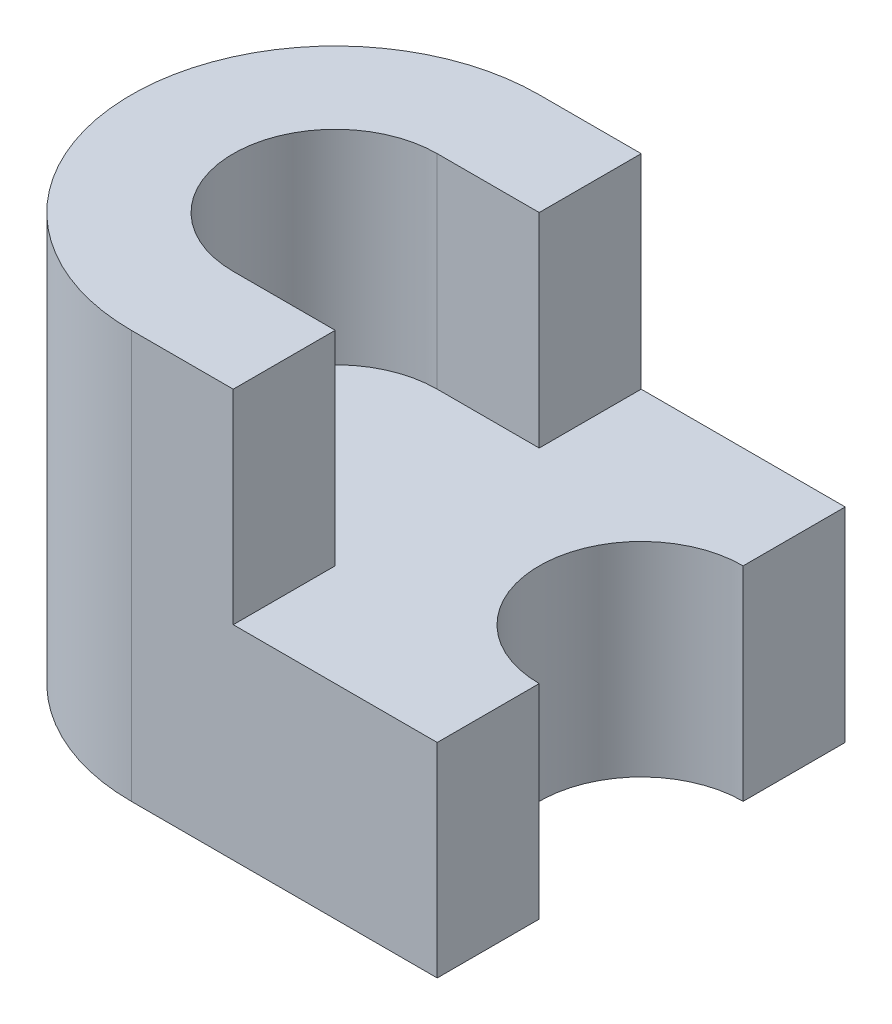
ISO-10303-21;
HEADER;
FILE_DESCRIPTION(('STEP AP214'),'2;1');
FILE_NAME('part.step','',(''),(''),'','','');
FILE_SCHEMA(('AUTOMOTIVE_DESIGN { 1 0 10303 214 1 1 1 1 }'));
ENDSEC;
DATA;
#1=APPLICATION_CONTEXT('core data for automotive mechanical design processes');
#2=APPLICATION_PROTOCOL_DEFINITION('international standard','automotive_design',2000,#1);
#3=PRODUCT_CONTEXT('',#1,'mechanical');
#4=PRODUCT('Part','Part','',(#3));
#5=PRODUCT_RELATED_PRODUCT_CATEGORY('part','',(#4));
#6=PRODUCT_DEFINITION_FORMATION('','',#4);
#7=PRODUCT_DEFINITION_CONTEXT('part definition',#1,'design');
#8=PRODUCT_DEFINITION('design','',#6,#7);
#9=PRODUCT_DEFINITION_SHAPE('','',#8);
#10=(LENGTH_UNIT() NAMED_UNIT(*) SI_UNIT(.MILLI.,.METRE.));
#11=(NAMED_UNIT(*) PLANE_ANGLE_UNIT() SI_UNIT($,.RADIAN.));
#12=(NAMED_UNIT(*) SI_UNIT($,.STERADIAN.) SOLID_ANGLE_UNIT());
#13=UNCERTAINTY_MEASURE_WITH_UNIT(LENGTH_MEASURE(1.E-05),#10,'distance_accuracy_value','');
#14=(GEOMETRIC_REPRESENTATION_CONTEXT(3) GLOBAL_UNCERTAINTY_ASSIGNED_CONTEXT((#13)) GLOBAL_UNIT_ASSIGNED_CONTEXT((#10,
#11,#12)) REPRESENTATION_CONTEXT('',''));
#15=CARTESIAN_POINT('',(0.,0.,0.));
#16=DIRECTION('',(0.,0.,1.));
#17=DIRECTION('',(1.,0.,0.));
#18=AXIS2_PLACEMENT_3D('',#15,#16,#17);
#19=CARTESIAN_POINT('',(0.,10.,-10.));
#20=DIRECTION('',(0.,0.,-1.));
#21=DIRECTION('',(-1.,0.,0.));
#22=AXIS2_PLACEMENT_3D('',#19,#20,#21);
#23=PLANE('',#22);
#24=DIRECTION('',(0.,-1.,0.));
#25=VECTOR('',#24,1.);
#26=CARTESIAN_POINT('',(15.,10.,-10.));
#27=LINE('',#26,#25);
#28=CARTESIAN_POINT('',(15.,10.,-10.));
#29=VERTEX_POINT('',#28);
#30=CARTESIAN_POINT('',(15.,0.,-10.));
#31=VERTEX_POINT('',#30);
#32=EDGE_CURVE('E198',#29,#31,#27,.T.);
#33=ORIENTED_EDGE('',*,*,#32,.T.);
#34=DIRECTION('',(1.,0.,0.));
#35=VECTOR('',#34,1.);
#36=CARTESIAN_POINT('',(0.,0.,-10.));
#37=LINE('',#36,#35);
#38=CARTESIAN_POINT('',(0.,0.,-10.));
#39=VERTEX_POINT('',#38);
#40=EDGE_CURVE('E182',#39,#31,#37,.T.);
#41=ORIENTED_EDGE('',*,*,#40,.F.);
#42=DIRECTION('',(0.,-1.,0.));
#43=VECTOR('',#42,1.);
#44=CARTESIAN_POINT('',(0.,10.,-10.));
#45=LINE('',#44,#43);
#46=CARTESIAN_POINT('',(0.,20.,-10.));
#47=VERTEX_POINT('',#46);
#48=EDGE_CURVE('E11',#47,#39,#45,.T.);
#49=ORIENTED_EDGE('',*,*,#48,.F.);
#50=DIRECTION('',(1.,0.,0.));
#51=VECTOR('',#50,1.);
#52=CARTESIAN_POINT('',(0.,20.,-10.));
#53=LINE('',#52,#51);
#54=CARTESIAN_POINT('',(5.,20.,-10.));
#55=VERTEX_POINT('',#54);
#56=EDGE_CURVE('E151',#47,#55,#53,.T.);
#57=ORIENTED_EDGE('',*,*,#56,.T.);
#58=DIRECTION('',(0.,-1.,0.));
#59=VECTOR('',#58,1.);
#60=CARTESIAN_POINT('',(5.,20.,-10.));
#61=LINE('',#60,#59);
#62=CARTESIAN_POINT('',(5.,10.,-10.));
#63=VERTEX_POINT('',#62);
#64=EDGE_CURVE('E171',#55,#63,#61,.T.);
#65=ORIENTED_EDGE('',*,*,#64,.T.);
#66=DIRECTION('',(1.,0.,0.));
#67=VECTOR('',#66,1.);
#68=CARTESIAN_POINT('',(0.,10.,-10.));
#69=LINE('',#68,#67);
#70=EDGE_CURVE('E183',#63,#29,#69,.T.);
#71=ORIENTED_EDGE('',*,*,#70,.T.);
#72=EDGE_LOOP('',(#33,#41,#49,#57,#65,#71));
#73=FACE_BOUND('',#72,.T.);
#74=ADVANCED_FACE('F39',(#73),#23,.T.);
#75=CARTESIAN_POINT('',(0.,10.,0.));
#76=DIRECTION('',(0.,-1.,0.));
#77=DIRECTION('',(0.,0.,-1.));
#78=AXIS2_PLACEMENT_3D('',#75,#76,#77);
#79=CYLINDRICAL_SURFACE('',#78,10.);
#80=CARTESIAN_POINT('',(0.,0.,0.));
#81=DIRECTION('',(0.,1.,0.));
#82=DIRECTION('',(0.,0.,1.));
#83=AXIS2_PLACEMENT_3D('',#80,#81,#82);
#84=CIRCLE('',#83,10.);
#85=CARTESIAN_POINT('',(0.,0.,10.));
#86=VERTEX_POINT('',#85);
#87=EDGE_CURVE('E200',#39,#86,#84,.T.);
#88=ORIENTED_EDGE('',*,*,#87,.T.);
#89=DIRECTION('',(0.,-1.,0.));
#90=VECTOR('',#89,1.);
#91=CARTESIAN_POINT('',(0.,10.,10.));
#92=LINE('',#91,#90);
#93=CARTESIAN_POINT('',(0.,20.,10.));
#94=VERTEX_POINT('',#93);
#95=EDGE_CURVE('E46',#94,#86,#92,.T.);
#96=ORIENTED_EDGE('',*,*,#95,.F.);
#97=CARTESIAN_POINT('',(0.,20.,0.));
#98=DIRECTION('',(0.,1.,0.));
#99=DIRECTION('',(0.,0.,1.));
#100=AXIS2_PLACEMENT_3D('',#97,#98,#99);
#101=CIRCLE('',#100,10.);
#102=EDGE_CURVE('E154',#47,#94,#101,.T.);
#103=ORIENTED_EDGE('',*,*,#102,.F.);
#104=ORIENTED_EDGE('',*,*,#48,.T.);
#105=EDGE_LOOP('',(#88,#96,#103,#104));
#106=FACE_BOUND('',#105,.T.);
#107=ADVANCED_FACE('F228',(#106),#79,.T.);
#108=CARTESIAN_POINT('',(0.,10.,10.));
#109=DIRECTION('',(0.,0.,1.));
#110=DIRECTION('',(1.,0.,0.));
#111=AXIS2_PLACEMENT_3D('',#108,#109,#110);
#112=PLANE('',#111);
#113=ORIENTED_EDGE('',*,*,#95,.T.);
#114=DIRECTION('',(-1.,0.,0.));
#115=VECTOR('',#114,1.);
#116=CARTESIAN_POINT('',(0.,0.,10.));
#117=LINE('',#116,#115);
#118=CARTESIAN_POINT('',(15.,0.,10.));
#119=VERTEX_POINT('',#118);
#120=EDGE_CURVE('E203',#119,#86,#117,.T.);
#121=ORIENTED_EDGE('',*,*,#120,.F.);
#122=DIRECTION('',(0.,-1.,0.));
#123=VECTOR('',#122,1.);
#124=CARTESIAN_POINT('',(15.,10.,10.));
#125=LINE('',#124,#123);
#126=CARTESIAN_POINT('',(15.,10.,10.));
#127=VERTEX_POINT('',#126);
#128=EDGE_CURVE('E219',#127,#119,#125,.T.);
#129=ORIENTED_EDGE('',*,*,#128,.F.);
#130=DIRECTION('',(-1.,0.,0.));
#131=VECTOR('',#130,1.);
#132=CARTESIAN_POINT('',(0.,10.,10.));
#133=LINE('',#132,#131);
#134=CARTESIAN_POINT('',(5.,10.,10.));
#135=VERTEX_POINT('',#134);
#136=EDGE_CURVE('E185',#127,#135,#133,.T.);
#137=ORIENTED_EDGE('',*,*,#136,.T.);
#138=DIRECTION('',(0.,-1.,0.));
#139=VECTOR('',#138,1.);
#140=CARTESIAN_POINT('',(5.,20.,10.));
#141=LINE('',#140,#139);
#142=CARTESIAN_POINT('',(5.,20.,10.));
#143=VERTEX_POINT('',#142);
#144=EDGE_CURVE('E168',#143,#135,#141,.T.);
#145=ORIENTED_EDGE('',*,*,#144,.F.);
#146=DIRECTION('',(-1.,0.,0.));
#147=VECTOR('',#146,1.);
#148=CARTESIAN_POINT('',(0.,20.,10.));
#149=LINE('',#148,#147);
#150=EDGE_CURVE('E157',#143,#94,#149,.T.);
#151=ORIENTED_EDGE('',*,*,#150,.T.);
#152=EDGE_LOOP('',(#113,#121,#129,#137,#145,#151));
#153=FACE_BOUND('',#152,.T.);
#154=ADVANCED_FACE('F223',(#153),#112,.T.);
#155=CARTESIAN_POINT('',(15.,10.,0.));
#156=DIRECTION('',(1.,0.,0.));
#157=DIRECTION('',(0.,0.,-1.));
#158=AXIS2_PLACEMENT_3D('',#155,#156,#157);
#159=PLANE('',#158);
#160=DIRECTION('',(0.,0.,1.));
#161=VECTOR('',#160,1.);
#162=CARTESIAN_POINT('',(15.,0.,0.));
#163=LINE('',#162,#161);
#164=CARTESIAN_POINT('',(15.,0.,5.));
#165=VERTEX_POINT('',#164);
#166=EDGE_CURVE('E205',#165,#119,#163,.T.);
#167=ORIENTED_EDGE('',*,*,#166,.F.);
#168=DIRECTION('',(0.,-1.,0.));
#169=VECTOR('',#168,1.);
#170=CARTESIAN_POINT('',(15.,10.,5.));
#171=LINE('',#170,#169);
#172=CARTESIAN_POINT('',(15.,10.,5.));
#173=VERTEX_POINT('',#172);
#174=EDGE_CURVE('E217',#173,#165,#171,.T.);
#175=ORIENTED_EDGE('',*,*,#174,.F.);
#176=DIRECTION('',(0.,0.,1.));
#177=VECTOR('',#176,1.);
#178=CARTESIAN_POINT('',(15.,10.,0.));
#179=LINE('',#178,#177);
#180=EDGE_CURVE('E189',#173,#127,#179,.T.);
#181=ORIENTED_EDGE('',*,*,#180,.T.);
#182=ORIENTED_EDGE('',*,*,#128,.T.);
#183=EDGE_LOOP('',(#167,#175,#181,#182));
#184=FACE_BOUND('',#183,.T.);
#185=ADVANCED_FACE('F245',(#184),#159,.T.);
#186=CARTESIAN_POINT('',(15.,10.,0.));
#187=DIRECTION('',(0.,-1.,0.));
#188=DIRECTION('',(0.,0.,-1.));
#189=AXIS2_PLACEMENT_3D('',#186,#187,#188);
#190=CYLINDRICAL_SURFACE('',#189,5.);
#191=CARTESIAN_POINT('',(15.,0.,0.));
#192=DIRECTION('',(0.,1.,0.));
#193=DIRECTION('',(0.,0.,1.));
#194=AXIS2_PLACEMENT_3D('',#191,#192,#193);
#195=CIRCLE('',#194,5.);
#196=CARTESIAN_POINT('',(15.,0.,-5.));
#197=VERTEX_POINT('',#196);
#198=EDGE_CURVE('E208',#197,#165,#195,.T.);
#199=ORIENTED_EDGE('',*,*,#198,.F.);
#200=DIRECTION('',(0.,-1.,0.));
#201=VECTOR('',#200,1.);
#202=CARTESIAN_POINT('',(15.,10.,-5.));
#203=LINE('',#202,#201);
#204=CARTESIAN_POINT('',(15.,10.,-5.));
#205=VERTEX_POINT('',#204);
#206=EDGE_CURVE('E215',#205,#197,#203,.T.);
#207=ORIENTED_EDGE('',*,*,#206,.F.);
#208=CARTESIAN_POINT('',(15.,10.,0.));
#209=DIRECTION('',(0.,1.,0.));
#210=DIRECTION('',(0.,0.,1.));
#211=AXIS2_PLACEMENT_3D('',#208,#209,#210);
#212=CIRCLE('',#211,5.);
#213=EDGE_CURVE('E192',#205,#173,#212,.T.);
#214=ORIENTED_EDGE('',*,*,#213,.T.);
#215=ORIENTED_EDGE('',*,*,#174,.T.);
#216=EDGE_LOOP('',(#199,#207,#214,#215));
#217=FACE_BOUND('',#216,.T.);
#218=ADVANCED_FACE('F241',(#217),#190,.F.);
#219=CARTESIAN_POINT('',(15.,10.,0.));
#220=DIRECTION('',(1.,0.,0.));
#221=DIRECTION('',(0.,0.,-1.));
#222=AXIS2_PLACEMENT_3D('',#219,#220,#221);
#223=PLANE('',#222);
#224=DIRECTION('',(0.,0.,1.));
#225=VECTOR('',#224,1.);
#226=CARTESIAN_POINT('',(15.,0.,0.));
#227=LINE('',#226,#225);
#228=EDGE_CURVE('E186',#31,#197,#227,.T.);
#229=ORIENTED_EDGE('',*,*,#228,.F.);
#230=ORIENTED_EDGE('',*,*,#32,.F.);
#231=DIRECTION('',(0.,0.,1.));
#232=VECTOR('',#231,1.);
#233=CARTESIAN_POINT('',(15.,10.,0.));
#234=LINE('',#233,#232);
#235=EDGE_CURVE('E195',#29,#205,#234,.T.);
#236=ORIENTED_EDGE('',*,*,#235,.T.);
#237=ORIENTED_EDGE('',*,*,#206,.T.);
#238=EDGE_LOOP('',(#229,#230,#236,#237));
#239=FACE_BOUND('',#238,.T.);
#240=ADVANCED_FACE('F237',(#239),#223,.T.);
#241=CARTESIAN_POINT('',(0.,10.,0.));
#242=DIRECTION('',(0.,1.,0.));
#243=DIRECTION('',(0.,0.,1.));
#244=AXIS2_PLACEMENT_3D('',#241,#242,#243);
#245=PLANE('',#244);
#246=DIRECTION('',(0.,0.,-1.));
#247=VECTOR('',#246,1.);
#248=CARTESIAN_POINT('',(5.,10.,0.));
#249=LINE('',#248,#247);
#250=CARTESIAN_POINT('',(5.,10.,-5.));
#251=VERTEX_POINT('',#250);
#252=EDGE_CURVE('E53',#251,#63,#249,.T.);
#253=ORIENTED_EDGE('',*,*,#252,.F.);
#254=DIRECTION('',(-1.,0.,0.));
#255=VECTOR('',#254,1.);
#256=CARTESIAN_POINT('',(0.,10.,-5.));
#257=LINE('',#256,#255);
#258=CARTESIAN_POINT('',(0.,10.,-5.));
#259=VERTEX_POINT('',#258);
#260=EDGE_CURVE('E57',#251,#259,#257,.T.);
#261=ORIENTED_EDGE('',*,*,#260,.T.);
#262=CARTESIAN_POINT('',(0.,10.,0.));
#263=DIRECTION('',(0.,1.,0.));
#264=DIRECTION('',(0.,0.,1.));
#265=AXIS2_PLACEMENT_3D('',#262,#263,#264);
#266=CIRCLE('',#265,5.);
#267=CARTESIAN_POINT('',(0.,10.,5.));
#268=VERTEX_POINT('',#267);
#269=EDGE_CURVE('E131',#268,#259,#266,.F.);
#270=ORIENTED_EDGE('',*,*,#269,.F.);
#271=DIRECTION('',(-1.,0.,0.));
#272=VECTOR('',#271,1.);
#273=CARTESIAN_POINT('',(0.,10.,5.));
#274=LINE('',#273,#272);
#275=CARTESIAN_POINT('',(5.,10.,5.));
#276=VERTEX_POINT('',#275);
#277=EDGE_CURVE('E133',#276,#268,#274,.T.);
#278=ORIENTED_EDGE('',*,*,#277,.F.);
#279=DIRECTION('',(0.,0.,1.));
#280=VECTOR('',#279,1.);
#281=CARTESIAN_POINT('',(5.,10.,0.));
#282=LINE('',#281,#280);
#283=EDGE_CURVE('E177',#276,#135,#282,.T.);
#284=ORIENTED_EDGE('',*,*,#283,.T.);
#285=ORIENTED_EDGE('',*,*,#136,.F.);
#286=ORIENTED_EDGE('',*,*,#180,.F.);
#287=ORIENTED_EDGE('',*,*,#213,.F.);
#288=ORIENTED_EDGE('',*,*,#235,.F.);
#289=ORIENTED_EDGE('',*,*,#70,.F.);
#290=EDGE_LOOP('',(#253,#261,#270,#278,#284,#285,#286,#287,#288,#289));
#291=FACE_BOUND('',#290,.T.);
#292=ADVANCED_FACE('F247',(#291),#245,.T.);
#293=CARTESIAN_POINT('',(0.,0.,0.));
#294=DIRECTION('',(0.,1.,0.));
#295=DIRECTION('',(0.,0.,1.));
#296=AXIS2_PLACEMENT_3D('',#293,#294,#295);
#297=PLANE('',#296);
#298=ORIENTED_EDGE('',*,*,#40,.T.);
#299=ORIENTED_EDGE('',*,*,#228,.T.);
#300=ORIENTED_EDGE('',*,*,#198,.T.);
#301=ORIENTED_EDGE('',*,*,#166,.T.);
#302=ORIENTED_EDGE('',*,*,#120,.T.);
#303=ORIENTED_EDGE('',*,*,#87,.F.);
#304=EDGE_LOOP('',(#298,#299,#300,#301,#302,#303));
#305=FACE_BOUND('',#304,.T.);
#306=ADVANCED_FACE('F231',(#305),#297,.F.);
#307=CARTESIAN_POINT('',(0.,20.,0.));
#308=DIRECTION('',(0.,-1.,0.));
#309=DIRECTION('',(0.,0.,-1.));
#310=AXIS2_PLACEMENT_3D('',#307,#308,#309);
#311=CYLINDRICAL_SURFACE('',#310,5.);
#312=DIRECTION('',(0.,-1.,0.));
#313=VECTOR('',#312,1.);
#314=CARTESIAN_POINT('',(0.,20.,5.));
#315=LINE('',#314,#313);
#316=CARTESIAN_POINT('',(0.,20.,5.));
#317=VERTEX_POINT('',#316);
#318=EDGE_CURVE('E163',#317,#268,#315,.T.);
#319=ORIENTED_EDGE('',*,*,#318,.T.);
#320=ORIENTED_EDGE('',*,*,#269,.T.);
#321=DIRECTION('',(0.,-1.,0.));
#322=VECTOR('',#321,1.);
#323=CARTESIAN_POINT('',(0.,20.,-5.));
#324=LINE('',#323,#322);
#325=CARTESIAN_POINT('',(0.,20.,-5.));
#326=VERTEX_POINT('',#325);
#327=EDGE_CURVE('E124',#326,#259,#324,.T.);
#328=ORIENTED_EDGE('',*,*,#327,.F.);
#329=CARTESIAN_POINT('',(0.,20.,0.));
#330=DIRECTION('',(0.,1.,0.));
#331=DIRECTION('',(0.,0.,1.));
#332=AXIS2_PLACEMENT_3D('',#329,#330,#331);
#333=CIRCLE('',#332,5.);
#334=EDGE_CURVE('E129',#326,#317,#333,.T.);
#335=ORIENTED_EDGE('',*,*,#334,.T.);
#336=EDGE_LOOP('',(#319,#320,#328,#335));
#337=FACE_BOUND('',#336,.T.);
#338=ADVANCED_FACE('F127',(#337),#311,.F.);
#339=CARTESIAN_POINT('',(0.,20.,-5.));
#340=DIRECTION('',(0.,0.,-1.));
#341=DIRECTION('',(-1.,0.,0.));
#342=AXIS2_PLACEMENT_3D('',#339,#340,#341);
#343=PLANE('',#342);
#344=ORIENTED_EDGE('',*,*,#260,.F.);
#345=DIRECTION('',(0.,-1.,0.));
#346=VECTOR('',#345,1.);
#347=CARTESIAN_POINT('',(5.,20.,-5.));
#348=LINE('',#347,#346);
#349=CARTESIAN_POINT('',(5.,20.,-5.));
#350=VERTEX_POINT('',#349);
#351=EDGE_CURVE('E134',#350,#251,#348,.T.);
#352=ORIENTED_EDGE('',*,*,#351,.F.);
#353=DIRECTION('',(1.,0.,0.));
#354=VECTOR('',#353,1.);
#355=CARTESIAN_POINT('',(0.,20.,-5.));
#356=LINE('',#355,#354);
#357=EDGE_CURVE('E137',#326,#350,#356,.T.);
#358=ORIENTED_EDGE('',*,*,#357,.F.);
#359=ORIENTED_EDGE('',*,*,#327,.T.);
#360=EDGE_LOOP('',(#344,#352,#358,#359));
#361=FACE_BOUND('',#360,.T.);
#362=ADVANCED_FACE('F138',(#361),#343,.F.);
#363=CARTESIAN_POINT('',(5.,20.,0.));
#364=DIRECTION('',(1.,0.,0.));
#365=DIRECTION('',(0.,0.,-1.));
#366=AXIS2_PLACEMENT_3D('',#363,#364,#365);
#367=PLANE('',#366);
#368=ORIENTED_EDGE('',*,*,#351,.T.);
#369=ORIENTED_EDGE('',*,*,#252,.T.);
#370=ORIENTED_EDGE('',*,*,#64,.F.);
#371=DIRECTION('',(0.,0.,1.));
#372=VECTOR('',#371,1.);
#373=CARTESIAN_POINT('',(5.,20.,0.));
#374=LINE('',#373,#372);
#375=EDGE_CURVE('E143',#55,#350,#374,.T.);
#376=ORIENTED_EDGE('',*,*,#375,.T.);
#377=EDGE_LOOP('',(#368,#369,#370,#376));
#378=FACE_BOUND('',#377,.T.);
#379=ADVANCED_FACE('F262',(#378),#367,.T.);
#380=CARTESIAN_POINT('',(5.,20.,0.));
#381=DIRECTION('',(-1.,0.,0.));
#382=DIRECTION('',(0.,0.,1.));
#383=AXIS2_PLACEMENT_3D('',#380,#381,#382);
#384=PLANE('',#383);
#385=ORIENTED_EDGE('',*,*,#283,.F.);
#386=DIRECTION('',(0.,-1.,0.));
#387=VECTOR('',#386,1.);
#388=CARTESIAN_POINT('',(5.,20.,5.));
#389=LINE('',#388,#387);
#390=CARTESIAN_POINT('',(5.,20.,5.));
#391=VERTEX_POINT('',#390);
#392=EDGE_CURVE('E165',#391,#276,#389,.T.);
#393=ORIENTED_EDGE('',*,*,#392,.F.);
#394=DIRECTION('',(0.,0.,-1.));
#395=VECTOR('',#394,1.);
#396=CARTESIAN_POINT('',(5.,20.,0.));
#397=LINE('',#396,#395);
#398=EDGE_CURVE('E160',#143,#391,#397,.T.);
#399=ORIENTED_EDGE('',*,*,#398,.F.);
#400=ORIENTED_EDGE('',*,*,#144,.T.);
#401=EDGE_LOOP('',(#385,#393,#399,#400));
#402=FACE_BOUND('',#401,.T.);
#403=ADVANCED_FACE('F251',(#402),#384,.F.);
#404=CARTESIAN_POINT('',(0.,20.,5.));
#405=DIRECTION('',(0.,0.,-1.));
#406=DIRECTION('',(-1.,0.,0.));
#407=AXIS2_PLACEMENT_3D('',#404,#405,#406);
#408=PLANE('',#407);
#409=ORIENTED_EDGE('',*,*,#392,.T.);
#410=ORIENTED_EDGE('',*,*,#277,.T.);
#411=ORIENTED_EDGE('',*,*,#318,.F.);
#412=DIRECTION('',(1.,0.,0.));
#413=VECTOR('',#412,1.);
#414=CARTESIAN_POINT('',(0.,20.,5.));
#415=LINE('',#414,#413);
#416=EDGE_CURVE('E147',#317,#391,#415,.T.);
#417=ORIENTED_EDGE('',*,*,#416,.T.);
#418=EDGE_LOOP('',(#409,#410,#411,#417));
#419=FACE_BOUND('',#418,.T.);
#420=ADVANCED_FACE('F254',(#419),#408,.T.);
#421=CARTESIAN_POINT('',(0.,20.,0.));
#422=DIRECTION('',(0.,1.,0.));
#423=DIRECTION('',(0.,0.,1.));
#424=AXIS2_PLACEMENT_3D('',#421,#422,#423);
#425=PLANE('',#424);
#426=ORIENTED_EDGE('',*,*,#334,.F.);
#427=ORIENTED_EDGE('',*,*,#357,.T.);
#428=ORIENTED_EDGE('',*,*,#375,.F.);
#429=ORIENTED_EDGE('',*,*,#56,.F.);
#430=ORIENTED_EDGE('',*,*,#102,.T.);
#431=ORIENTED_EDGE('',*,*,#150,.F.);
#432=ORIENTED_EDGE('',*,*,#398,.T.);
#433=ORIENTED_EDGE('',*,*,#416,.F.);
#434=EDGE_LOOP('',(#426,#427,#428,#429,#430,#431,#432,#433));
#435=FACE_BOUND('',#434,.T.);
#436=ADVANCED_FACE('F145',(#435),#425,.T.);
#437=CLOSED_SHELL('',(#74,#107,#154,#185,#218,#240,#292,#306,#338,#362,#379,#403,#420,#436));
#438=MANIFOLD_SOLID_BREP('B2',#437);
#439=ADVANCED_BREP_SHAPE_REPRESENTATION('',(#18,#438),#14);
#440=SHAPE_DEFINITION_REPRESENTATION(#9,#439);
ENDSEC;
END-ISO-10303-21;
